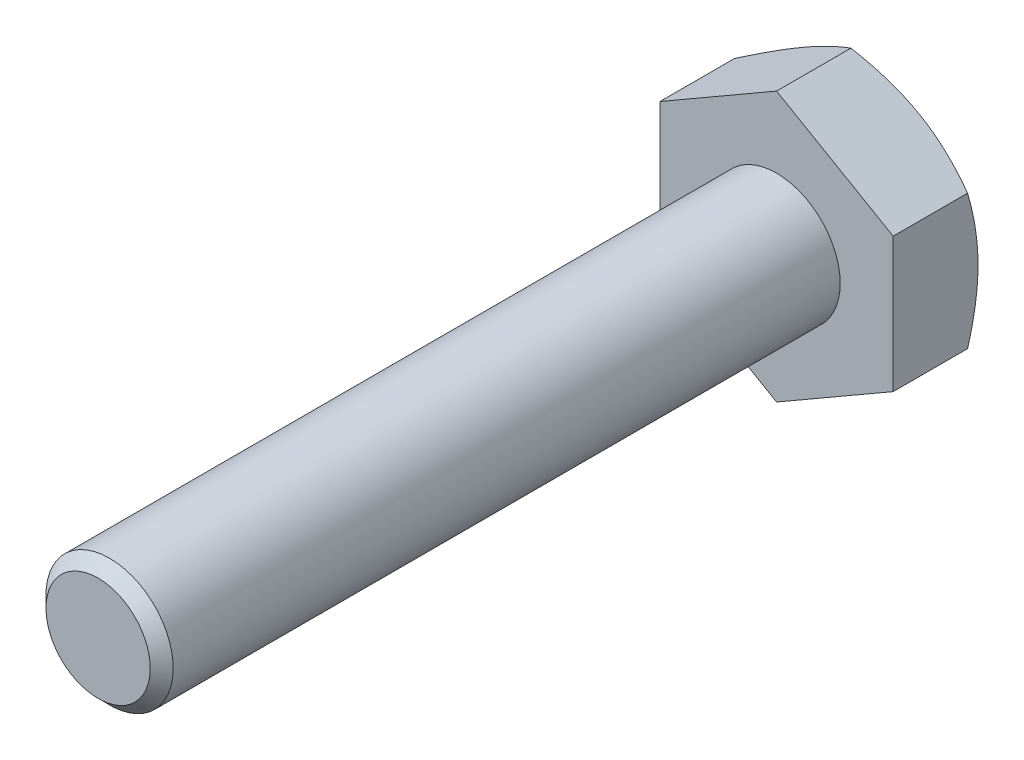
ISO-10303-21;
HEADER;
FILE_DESCRIPTION(('STEP AP214'),'2;1');
FILE_NAME('part.step','',(''),(''),'','','');
FILE_SCHEMA(('AUTOMOTIVE_DESIGN { 1 0 10303 214 1 1 1 1 }'));
ENDSEC;
DATA;
#1=APPLICATION_CONTEXT('core data for automotive mechanical design processes');
#2=APPLICATION_PROTOCOL_DEFINITION('international standard','automotive_design',2000,#1);
#3=PRODUCT_CONTEXT('',#1,'mechanical');
#4=PRODUCT('Part','Part','',(#3));
#5=PRODUCT_RELATED_PRODUCT_CATEGORY('part','',(#4));
#6=PRODUCT_DEFINITION_FORMATION('','',#4);
#7=PRODUCT_DEFINITION_CONTEXT('part definition',#1,'design');
#8=PRODUCT_DEFINITION('design','',#6,#7);
#9=PRODUCT_DEFINITION_SHAPE('','',#8);
#10=(LENGTH_UNIT() NAMED_UNIT(*) SI_UNIT(.MILLI.,.METRE.));
#11=(NAMED_UNIT(*) PLANE_ANGLE_UNIT() SI_UNIT($,.RADIAN.));
#12=(NAMED_UNIT(*) SI_UNIT($,.STERADIAN.) SOLID_ANGLE_UNIT());
#13=UNCERTAINTY_MEASURE_WITH_UNIT(LENGTH_MEASURE(1.E-05),#10,'distance_accuracy_value','');
#14=(GEOMETRIC_REPRESENTATION_CONTEXT(3) GLOBAL_UNCERTAINTY_ASSIGNED_CONTEXT((#13)) GLOBAL_UNIT_ASSIGNED_CONTEXT((#10,
#11,#12)) REPRESENTATION_CONTEXT('',''));
#15=CARTESIAN_POINT('',(0.,0.,0.));
#16=DIRECTION('',(0.,0.,1.));
#17=DIRECTION('',(1.,0.,0.));
#18=AXIS2_PLACEMENT_3D('',#15,#16,#17);
#19=CARTESIAN_POINT('',(0.,0.,0.));
#20=DIRECTION('',(0.,0.,-1.));
#21=DIRECTION('',(-1.,0.,0.));
#22=AXIS2_PLACEMENT_3D('',#19,#20,#21);
#23=PLANE('',#22);
#24=DIRECTION('',(0.866025403784439,-0.5,0.));
#25=VECTOR('',#24,1.);
#26=CARTESIAN_POINT('',(0.,3.17542648054294,0.));
#27=LINE('',#26,#25);
#28=CARTESIAN_POINT('',(0.,3.17542648054294,0.));
#29=VERTEX_POINT('',#28);
#30=CARTESIAN_POINT('',(2.75,1.58771324027147,0.));
#31=VERTEX_POINT('',#30);
#32=EDGE_CURVE('E9',#29,#31,#27,.T.);
#33=ORIENTED_EDGE('',*,*,#32,.F.);
#34=DIRECTION('',(0.866025403784439,0.5,0.));
#35=VECTOR('',#34,1.);
#36=CARTESIAN_POINT('',(-2.75,1.58771324027147,0.));
#37=LINE('',#36,#35);
#38=CARTESIAN_POINT('',(-2.75,1.58771324027147,0.));
#39=VERTEX_POINT('',#38);
#40=EDGE_CURVE('E19',#39,#29,#37,.T.);
#41=ORIENTED_EDGE('',*,*,#40,.F.);
#42=DIRECTION('',(0.,1.,0.));
#43=VECTOR('',#42,1.);
#44=CARTESIAN_POINT('',(-2.75,-1.58771324027147,0.));
#45=LINE('',#44,#43);
#46=CARTESIAN_POINT('',(-2.75,-1.58771324027147,0.));
#47=VERTEX_POINT('',#46);
#48=EDGE_CURVE('E24',#47,#39,#45,.T.);
#49=ORIENTED_EDGE('',*,*,#48,.F.);
#50=DIRECTION('',(-0.866025403784439,0.5,0.));
#51=VECTOR('',#50,1.);
#52=CARTESIAN_POINT('',(0.,-3.17542648054294,0.));
#53=LINE('',#52,#51);
#54=CARTESIAN_POINT('',(0.,-3.17542648054294,0.));
#55=VERTEX_POINT('',#54);
#56=EDGE_CURVE('E95',#55,#47,#53,.T.);
#57=ORIENTED_EDGE('',*,*,#56,.F.);
#58=DIRECTION('',(-0.866025403784439,-0.5,0.));
#59=VECTOR('',#58,1.);
#60=CARTESIAN_POINT('',(2.75,-1.58771324027147,0.));
#61=LINE('',#60,#59);
#62=CARTESIAN_POINT('',(2.75,-1.58771324027147,0.));
#63=VERTEX_POINT('',#62);
#64=EDGE_CURVE('E119',#63,#55,#61,.T.);
#65=ORIENTED_EDGE('',*,*,#64,.F.);
#66=DIRECTION('',(0.,-1.,0.));
#67=VECTOR('',#66,1.);
#68=CARTESIAN_POINT('',(2.75,1.58771324027147,0.));
#69=LINE('',#68,#67);
#70=EDGE_CURVE('E232',#31,#63,#69,.T.);
#71=ORIENTED_EDGE('',*,*,#70,.F.);
#72=EDGE_LOOP('',(#33,#41,#49,#57,#65,#71));
#73=FACE_BOUND('',#72,.T.);
#74=CARTESIAN_POINT('',(0.,0.,0.));
#75=DIRECTION('',(0.,0.,-1.));
#76=DIRECTION('',(0.,1.,0.));
#77=AXIS2_PLACEMENT_3D('',#74,#75,#76);
#78=CIRCLE('',#77,1.5);
#79=CARTESIAN_POINT('',(0.,-1.5,0.));
#80=VERTEX_POINT('',#79);
#81=EDGE_CURVE('E123',#80,#80,#78,.T.);
#82=ORIENTED_EDGE('',*,*,#81,.T.);
#83=EDGE_LOOP('',(#82));
#84=FACE_BOUND('',#83,.T.);
#85=ADVANCED_FACE('F15',(#73,#84),#23,.F.);
#86=CARTESIAN_POINT('',(0.,0.,-2.));
#87=DIRECTION('',(0.,0.,-1.));
#88=DIRECTION('',(-1.,0.,0.));
#89=AXIS2_PLACEMENT_3D('',#86,#87,#88);
#90=PLANE('',#89);
#91=CARTESIAN_POINT('',(0.,0.,-2.));
#92=DIRECTION('',(0.,0.,1.));
#93=DIRECTION('',(0.,1.,0.));
#94=AXIS2_PLACEMENT_3D('',#91,#92,#93);
#95=CIRCLE('',#94,2.75);
#96=CARTESIAN_POINT('',(1.375,-2.38156986040721,-2.));
#97=VERTEX_POINT('',#96);
#98=CARTESIAN_POINT('',(2.75,0.,-2.));
#99=VERTEX_POINT('',#98);
#100=EDGE_CURVE('E130',#97,#99,#95,.T.);
#101=ORIENTED_EDGE('',*,*,#100,.F.);
#102=CARTESIAN_POINT('',(0.,0.,-2.));
#103=DIRECTION('',(0.,0.,1.));
#104=DIRECTION('',(0.,1.,0.));
#105=AXIS2_PLACEMENT_3D('',#102,#103,#104);
#106=CIRCLE('',#105,2.75);
#107=CARTESIAN_POINT('',(-1.375,-2.38156986040721,-2.));
#108=VERTEX_POINT('',#107);
#109=EDGE_CURVE('E139',#108,#97,#106,.T.);
#110=ORIENTED_EDGE('',*,*,#109,.F.);
#111=CARTESIAN_POINT('',(0.,0.,-2.));
#112=DIRECTION('',(0.,0.,1.));
#113=DIRECTION('',(0.,1.,0.));
#114=AXIS2_PLACEMENT_3D('',#111,#112,#113);
#115=CIRCLE('',#114,2.75);
#116=CARTESIAN_POINT('',(-2.75,0.,-2.));
#117=VERTEX_POINT('',#116);
#118=EDGE_CURVE('E183',#117,#108,#115,.T.);
#119=ORIENTED_EDGE('',*,*,#118,.F.);
#120=CARTESIAN_POINT('',(0.,0.,-2.));
#121=DIRECTION('',(0.,0.,1.));
#122=DIRECTION('',(0.,1.,0.));
#123=AXIS2_PLACEMENT_3D('',#120,#121,#122);
#124=CIRCLE('',#123,2.75);
#125=CARTESIAN_POINT('',(-1.375,2.38156986040721,-2.));
#126=VERTEX_POINT('',#125);
#127=EDGE_CURVE('E195',#126,#117,#124,.T.);
#128=ORIENTED_EDGE('',*,*,#127,.F.);
#129=CARTESIAN_POINT('',(0.,0.,-2.));
#130=DIRECTION('',(0.,0.,1.));
#131=DIRECTION('',(0.,1.,0.));
#132=AXIS2_PLACEMENT_3D('',#129,#130,#131);
#133=CIRCLE('',#132,2.75);
#134=CARTESIAN_POINT('',(1.375,2.38156986040721,-2.));
#135=VERTEX_POINT('',#134);
#136=EDGE_CURVE('E149',#135,#126,#133,.T.);
#137=ORIENTED_EDGE('',*,*,#136,.F.);
#138=CARTESIAN_POINT('',(0.,0.,-2.));
#139=DIRECTION('',(0.,0.,1.));
#140=DIRECTION('',(0.,1.,0.));
#141=AXIS2_PLACEMENT_3D('',#138,#139,#140);
#142=CIRCLE('',#141,2.75);
#143=EDGE_CURVE('E115',#99,#135,#142,.T.);
#144=ORIENTED_EDGE('',*,*,#143,.F.);
#145=EDGE_LOOP('',(#101,#110,#119,#128,#137,#144));
#146=FACE_BOUND('',#145,.T.);
#147=ADVANCED_FACE('F256',(#146),#90,.T.);
#148=CARTESIAN_POINT('',(1.375,2.38156986040721,0.));
#149=DIRECTION('',(0.5,0.866025403784439,0.));
#150=DIRECTION('',(0.866025403784439,-0.5,0.));
#151=AXIS2_PLACEMENT_3D('',#148,#149,#150);
#152=PLANE('',#151);
#153=CARTESIAN_POINT('',(-0.00142582323748943,3.17624967997292,-1.75390444775792));
#154=CARTESIAN_POINT('',(0.736287321003483,2.75033079756067,-2.));
#155=CARTESIAN_POINT('',(1.375,2.38156986040721,-2.));
#156=CARTESIAN_POINT('',(2.01371267899652,2.01280892325374,-2.));
#157=CARTESIAN_POINT('',(2.75142582323749,1.58689004084149,-1.75390444775793));
#158=(BOUNDED_CURVE() B_SPLINE_CURVE(2,(#153,#154,#155,#156,#157),.UNSPECIFIED.,.F.,
.F.) B_SPLINE_CURVE_WITH_KNOTS((3,2,3),(0.,1.6124120093164,3.2248240186328),
.UNSPECIFIED.) CURVE() GEOMETRIC_REPRESENTATION_ITEM() RATIONAL_B_SPLINE_CURVE((1.,
1.03802697460134,1.,1.03802697460133,1.)) REPRESENTATION_ITEM(''));
#159=CARTESIAN_POINT('',(0.,3.17542648054294,-1.75437990693813));
#160=VERTEX_POINT('',#159);
#161=EDGE_CURVE('E211',#160,#135,#158,.T.);
#162=ORIENTED_EDGE('',*,*,#161,.F.);
#163=DIRECTION('',(0.,0.,-1.));
#164=VECTOR('',#163,1.);
#165=CARTESIAN_POINT('',(0.,3.17542648054294,0.));
#166=LINE('',#165,#164);
#167=EDGE_CURVE('E99',#29,#160,#166,.T.);
#168=ORIENTED_EDGE('',*,*,#167,.F.);
#169=ORIENTED_EDGE('',*,*,#32,.T.);
#170=DIRECTION('',(0.,0.,-1.));
#171=VECTOR('',#170,1.);
#172=CARTESIAN_POINT('',(2.75,1.58771324027147,0.));
#173=LINE('',#172,#171);
#174=CARTESIAN_POINT('',(2.75,1.58771324027147,-1.75437990693814));
#175=VERTEX_POINT('',#174);
#176=EDGE_CURVE('E236',#31,#175,#173,.T.);
#177=ORIENTED_EDGE('',*,*,#176,.T.);
#178=CARTESIAN_POINT('',(-0.00142582323748943,3.17624967997292,-1.75390444775792));
#179=CARTESIAN_POINT('',(0.736287321003483,2.75033079756067,-2.));
#180=CARTESIAN_POINT('',(1.375,2.38156986040721,-2.));
#181=CARTESIAN_POINT('',(2.01371267899652,2.01280892325374,-2.));
#182=CARTESIAN_POINT('',(2.75142582323749,1.58689004084149,-1.75390444775793));
#183=(BOUNDED_CURVE() B_SPLINE_CURVE(2,(#178,#179,#180,#181,#182),.UNSPECIFIED.,.F.,
.F.) B_SPLINE_CURVE_WITH_KNOTS((3,2,3),(0.,1.6124120093164,3.2248240186328),
.UNSPECIFIED.) CURVE() GEOMETRIC_REPRESENTATION_ITEM() RATIONAL_B_SPLINE_CURVE((1.,
1.03802697460134,1.,1.03802697460133,1.)) REPRESENTATION_ITEM(''));
#184=EDGE_CURVE('E140',#135,#175,#183,.T.);
#185=ORIENTED_EDGE('',*,*,#184,.F.);
#186=EDGE_LOOP('',(#162,#168,#169,#177,#185));
#187=FACE_BOUND('',#186,.T.);
#188=ADVANCED_FACE('F251',(#187),#152,.T.);
#189=CARTESIAN_POINT('',(-2.75,0.,0.));
#190=DIRECTION('',(-1.,0.,0.));
#191=DIRECTION('',(0.,1.,0.));
#192=AXIS2_PLACEMENT_3D('',#189,#190,#191);
#193=PLANE('',#192);
#194=CARTESIAN_POINT('',(-2.75,-1.58935963913144,-1.75390444775792));
#195=CARTESIAN_POINT('',(-2.75,-0.737521874306932,-2.));
#196=CARTESIAN_POINT('',(-2.75,0.,-2.));
#197=CARTESIAN_POINT('',(-2.75,0.737521874306931,-2.));
#198=CARTESIAN_POINT('',(-2.75,1.58935963913144,-1.75390444775792));
#199=(BOUNDED_CURVE() B_SPLINE_CURVE(2,(#194,#195,#196,#197,#198),.UNSPECIFIED.,.F.,
.F.) B_SPLINE_CURVE_WITH_KNOTS((3,2,3),(0.,1.6124120093164,3.22482401863281),
.UNSPECIFIED.) CURVE() GEOMETRIC_REPRESENTATION_ITEM() RATIONAL_B_SPLINE_CURVE((1.,
1.03802697460135,1.,1.03802697460135,1.)) REPRESENTATION_ITEM(''));
#200=CARTESIAN_POINT('',(-2.75,-1.58771324027147,-1.75437990693813));
#201=VERTEX_POINT('',#200);
#202=EDGE_CURVE('E106',#201,#117,#199,.T.);
#203=ORIENTED_EDGE('',*,*,#202,.F.);
#204=DIRECTION('',(0.,0.,-1.));
#205=VECTOR('',#204,1.);
#206=CARTESIAN_POINT('',(-2.75,-1.58771324027147,0.));
#207=LINE('',#206,#205);
#208=EDGE_CURVE('E102',#47,#201,#207,.T.);
#209=ORIENTED_EDGE('',*,*,#208,.F.);
#210=ORIENTED_EDGE('',*,*,#48,.T.);
#211=DIRECTION('',(0.,0.,-1.));
#212=VECTOR('',#211,1.);
#213=CARTESIAN_POINT('',(-2.75,1.58771324027147,0.));
#214=LINE('',#213,#212);
#215=CARTESIAN_POINT('',(-2.75,1.58771324027147,-1.75437990693813));
#216=VERTEX_POINT('',#215);
#217=EDGE_CURVE('E227',#39,#216,#214,.T.);
#218=ORIENTED_EDGE('',*,*,#217,.T.);
#219=CARTESIAN_POINT('',(-2.75,-1.58935963913144,-1.75390444775792));
#220=CARTESIAN_POINT('',(-2.75,-0.737521874306932,-2.));
#221=CARTESIAN_POINT('',(-2.75,0.,-2.));
#222=CARTESIAN_POINT('',(-2.75,0.737521874306931,-2.));
#223=CARTESIAN_POINT('',(-2.75,1.58935963913144,-1.75390444775792));
#224=(BOUNDED_CURVE() B_SPLINE_CURVE(2,(#219,#220,#221,#222,#223),.UNSPECIFIED.,.F.,
.F.) B_SPLINE_CURVE_WITH_KNOTS((3,2,3),(0.,1.6124120093164,3.22482401863281),
.UNSPECIFIED.) CURVE() GEOMETRIC_REPRESENTATION_ITEM() RATIONAL_B_SPLINE_CURVE((1.,
1.03802697460135,1.,1.03802697460135,1.)) REPRESENTATION_ITEM(''));
#225=EDGE_CURVE('E182',#117,#216,#224,.T.);
#226=ORIENTED_EDGE('',*,*,#225,.F.);
#227=EDGE_LOOP('',(#203,#209,#210,#218,#226));
#228=FACE_BOUND('',#227,.T.);
#229=ADVANCED_FACE('F103',(#228),#193,.T.);
#230=CARTESIAN_POINT('',(-1.375,2.38156986040721,0.));
#231=DIRECTION('',(-0.5,0.866025403784439,0.));
#232=DIRECTION('',(0.866025403784439,0.5,0.));
#233=AXIS2_PLACEMENT_3D('',#230,#231,#232);
#234=PLANE('',#233);
#235=CARTESIAN_POINT('',(-2.75142582323749,1.58689004084149,-1.75390444775792));
#236=CARTESIAN_POINT('',(-2.01371267899652,2.01280892325374,-2.));
#237=CARTESIAN_POINT('',(-1.375,2.38156986040721,-2.));
#238=CARTESIAN_POINT('',(-0.736287321003483,2.75033079756067,-2.));
#239=CARTESIAN_POINT('',(0.00142582323748969,3.17624967997292,-1.75390444775792));
#240=(BOUNDED_CURVE() B_SPLINE_CURVE(2,(#235,#236,#237,#238,#239),.UNSPECIFIED.,.F.,
.F.) B_SPLINE_CURVE_WITH_KNOTS((3,2,3),(0.,1.6124120093164,3.22482401863281),
.UNSPECIFIED.) CURVE() GEOMETRIC_REPRESENTATION_ITEM() RATIONAL_B_SPLINE_CURVE((1.,
1.03802697460133,1.,1.03802697460133,1.)) REPRESENTATION_ITEM(''));
#241=EDGE_CURVE('E190',#216,#126,#240,.T.);
#242=ORIENTED_EDGE('',*,*,#241,.F.);
#243=ORIENTED_EDGE('',*,*,#217,.F.);
#244=ORIENTED_EDGE('',*,*,#40,.T.);
#245=ORIENTED_EDGE('',*,*,#167,.T.);
#246=CARTESIAN_POINT('',(-2.75142582323749,1.58689004084149,-1.75390444775792));
#247=CARTESIAN_POINT('',(-2.01371267899652,2.01280892325374,-2.));
#248=CARTESIAN_POINT('',(-1.375,2.38156986040721,-2.));
#249=CARTESIAN_POINT('',(-0.736287321003483,2.75033079756067,-2.));
#250=CARTESIAN_POINT('',(0.00142582323748969,3.17624967997292,-1.75390444775792));
#251=(BOUNDED_CURVE() B_SPLINE_CURVE(2,(#246,#247,#248,#249,#250),.UNSPECIFIED.,.F.,
.F.) B_SPLINE_CURVE_WITH_KNOTS((3,2,3),(0.,1.6124120093164,3.22482401863281),
.UNSPECIFIED.) CURVE() GEOMETRIC_REPRESENTATION_ITEM() RATIONAL_B_SPLINE_CURVE((1.,
1.03802697460133,1.,1.03802697460133,1.)) REPRESENTATION_ITEM(''));
#252=EDGE_CURVE('E208',#126,#160,#251,.T.);
#253=ORIENTED_EDGE('',*,*,#252,.F.);
#254=EDGE_LOOP('',(#242,#243,#244,#245,#253));
#255=FACE_BOUND('',#254,.T.);
#256=ADVANCED_FACE('F315',(#255),#234,.T.);
#257=CARTESIAN_POINT('',(2.75,0.,0.));
#258=DIRECTION('',(1.,0.,0.));
#259=DIRECTION('',(0.,-1.,0.));
#260=AXIS2_PLACEMENT_3D('',#257,#258,#259);
#261=PLANE('',#260);
#262=CARTESIAN_POINT('',(2.75,1.58935963913144,-1.75390444775792));
#263=CARTESIAN_POINT('',(2.75,0.73752187430693,-2.));
#264=CARTESIAN_POINT('',(2.75,0.,-2.));
#265=CARTESIAN_POINT('',(2.75,-0.737521874306929,-2.));
#266=CARTESIAN_POINT('',(2.75,-1.58935963913144,-1.75390444775792));
#267=(BOUNDED_CURVE() B_SPLINE_CURVE(2,(#262,#263,#264,#265,#266),.UNSPECIFIED.,.F.,
.F.) B_SPLINE_CURVE_WITH_KNOTS((3,2,3),(0.,1.6124120093164,3.22482401863281),
.UNSPECIFIED.) CURVE() GEOMETRIC_REPRESENTATION_ITEM() RATIONAL_B_SPLINE_CURVE((1.,
1.03802697460133,1.,1.03802697460133,1.)) REPRESENTATION_ITEM(''));
#268=CARTESIAN_POINT('',(2.75,-1.58771324027147,-1.75437990693814));
#269=VERTEX_POINT('',#268);
#270=EDGE_CURVE('E124',#99,#269,#267,.T.);
#271=ORIENTED_EDGE('',*,*,#270,.F.);
#272=CARTESIAN_POINT('',(2.75,1.58935963913144,-1.75390444775792));
#273=CARTESIAN_POINT('',(2.75,0.73752187430693,-2.));
#274=CARTESIAN_POINT('',(2.75,0.,-2.));
#275=CARTESIAN_POINT('',(2.75,-0.737521874306929,-2.));
#276=CARTESIAN_POINT('',(2.75,-1.58935963913144,-1.75390444775792));
#277=(BOUNDED_CURVE() B_SPLINE_CURVE(2,(#272,#273,#274,#275,#276),.UNSPECIFIED.,.F.,
.F.) B_SPLINE_CURVE_WITH_KNOTS((3,2,3),(0.,1.6124120093164,3.22482401863281),
.UNSPECIFIED.) CURVE() GEOMETRIC_REPRESENTATION_ITEM() RATIONAL_B_SPLINE_CURVE((1.,
1.03802697460133,1.,1.03802697460133,1.)) REPRESENTATION_ITEM(''));
#278=EDGE_CURVE('E148',#175,#99,#277,.T.);
#279=ORIENTED_EDGE('',*,*,#278,.F.);
#280=ORIENTED_EDGE('',*,*,#176,.F.);
#281=ORIENTED_EDGE('',*,*,#70,.T.);
#282=DIRECTION('',(0.,0.,-1.));
#283=VECTOR('',#282,1.);
#284=CARTESIAN_POINT('',(2.75,-1.58771324027147,0.));
#285=LINE('',#284,#283);
#286=EDGE_CURVE('E109',#63,#269,#285,.T.);
#287=ORIENTED_EDGE('',*,*,#286,.T.);
#288=EDGE_LOOP('',(#271,#279,#280,#281,#287));
#289=FACE_BOUND('',#288,.T.);
#290=ADVANCED_FACE('F246',(#289),#261,.T.);
#291=CARTESIAN_POINT('',(1.375,-2.38156986040721,0.));
#292=DIRECTION('',(0.5,-0.866025403784439,0.));
#293=DIRECTION('',(-0.866025403784439,-0.5,0.));
#294=AXIS2_PLACEMENT_3D('',#291,#292,#293);
#295=PLANE('',#294);
#296=CARTESIAN_POINT('',(2.75142582323749,-1.58689004084149,-1.75390444775792));
#297=CARTESIAN_POINT('',(2.01371267899651,-2.01280892325374,-2.));
#298=CARTESIAN_POINT('',(1.375,-2.38156986040721,-2.));
#299=CARTESIAN_POINT('',(0.736287321003486,-2.75033079756068,-2.));
#300=CARTESIAN_POINT('',(-0.00142582323748752,-3.17624967997292,-1.75390444775793));
#301=(BOUNDED_CURVE() B_SPLINE_CURVE(2,(#296,#297,#298,#299,#300),.UNSPECIFIED.,.F.,
.F.) B_SPLINE_CURVE_WITH_KNOTS((3,2,3),(0.,1.6124120093164,3.2248240186328),
.UNSPECIFIED.) CURVE() GEOMETRIC_REPRESENTATION_ITEM() RATIONAL_B_SPLINE_CURVE((1.,
1.03802697460135,1.,1.03802697460133,1.)) REPRESENTATION_ITEM(''));
#302=CARTESIAN_POINT('',(0.,-3.17542648054294,-1.75437990693814));
#303=VERTEX_POINT('',#302);
#304=EDGE_CURVE('E131',#97,#303,#301,.T.);
#305=ORIENTED_EDGE('',*,*,#304,.F.);
#306=CARTESIAN_POINT('',(2.75142582323749,-1.58689004084149,-1.75390444775792));
#307=CARTESIAN_POINT('',(2.01371267899651,-2.01280892325374,-2.));
#308=CARTESIAN_POINT('',(1.375,-2.38156986040721,-2.));
#309=CARTESIAN_POINT('',(0.736287321003486,-2.75033079756068,-2.));
#310=CARTESIAN_POINT('',(-0.00142582323748752,-3.17624967997292,-1.75390444775793));
#311=(BOUNDED_CURVE() B_SPLINE_CURVE(2,(#306,#307,#308,#309,#310),.UNSPECIFIED.,.F.,
.F.) B_SPLINE_CURVE_WITH_KNOTS((3,2,3),(0.,1.6124120093164,3.2248240186328),
.UNSPECIFIED.) CURVE() GEOMETRIC_REPRESENTATION_ITEM() RATIONAL_B_SPLINE_CURVE((1.,
1.03802697460135,1.,1.03802697460133,1.)) REPRESENTATION_ITEM(''));
#312=EDGE_CURVE('E122',#269,#97,#311,.T.);
#313=ORIENTED_EDGE('',*,*,#312,.F.);
#314=ORIENTED_EDGE('',*,*,#286,.F.);
#315=ORIENTED_EDGE('',*,*,#64,.T.);
#316=DIRECTION('',(0.,0.,-1.));
#317=VECTOR('',#316,1.);
#318=CARTESIAN_POINT('',(0.,-3.17542648054294,0.));
#319=LINE('',#318,#317);
#320=EDGE_CURVE('E113',#55,#303,#319,.T.);
#321=ORIENTED_EDGE('',*,*,#320,.T.);
#322=EDGE_LOOP('',(#305,#313,#314,#315,#321));
#323=FACE_BOUND('',#322,.T.);
#324=ADVANCED_FACE('F17',(#323),#295,.T.);
#325=CARTESIAN_POINT('',(-1.375,-2.38156986040721,0.));
#326=DIRECTION('',(-0.5,-0.866025403784439,0.));
#327=DIRECTION('',(-0.866025403784439,0.5,0.));
#328=AXIS2_PLACEMENT_3D('',#325,#326,#327);
#329=PLANE('',#328);
#330=CARTESIAN_POINT('',(0.00142582323748993,-3.17624967997292,-1.75390444775792));
#331=CARTESIAN_POINT('',(-0.736287321003482,-2.75033079756067,-2.));
#332=CARTESIAN_POINT('',(-1.375,-2.38156986040721,-2.));
#333=CARTESIAN_POINT('',(-2.01371267899651,-2.01280892325374,-2.));
#334=CARTESIAN_POINT('',(-2.75142582323749,-1.58689004084149,-1.75390444775792));
#335=(BOUNDED_CURVE() B_SPLINE_CURVE(2,(#330,#331,#332,#333,#334),.UNSPECIFIED.,.F.,
.F.) B_SPLINE_CURVE_WITH_KNOTS((3,2,3),(0.,1.6124120093164,3.2248240186328),
.UNSPECIFIED.) CURVE() GEOMETRIC_REPRESENTATION_ITEM() RATIONAL_B_SPLINE_CURVE((1.,
1.03802697460134,1.,1.03802697460133,1.)) REPRESENTATION_ITEM(''));
#336=EDGE_CURVE('E178',#108,#201,#335,.T.);
#337=ORIENTED_EDGE('',*,*,#336,.F.);
#338=CARTESIAN_POINT('',(0.00142582323748993,-3.17624967997292,-1.75390444775792));
#339=CARTESIAN_POINT('',(-0.736287321003482,-2.75033079756067,-2.));
#340=CARTESIAN_POINT('',(-1.375,-2.38156986040721,-2.));
#341=CARTESIAN_POINT('',(-2.01371267899651,-2.01280892325374,-2.));
#342=CARTESIAN_POINT('',(-2.75142582323749,-1.58689004084149,-1.75390444775792));
#343=(BOUNDED_CURVE() B_SPLINE_CURVE(2,(#338,#339,#340,#341,#342),.UNSPECIFIED.,.F.,
.F.) B_SPLINE_CURVE_WITH_KNOTS((3,2,3),(0.,1.6124120093164,3.2248240186328),
.UNSPECIFIED.) CURVE() GEOMETRIC_REPRESENTATION_ITEM() RATIONAL_B_SPLINE_CURVE((1.,
1.03802697460134,1.,1.03802697460133,1.)) REPRESENTATION_ITEM(''));
#344=EDGE_CURVE('E129',#303,#108,#343,.T.);
#345=ORIENTED_EDGE('',*,*,#344,.F.);
#346=ORIENTED_EDGE('',*,*,#320,.F.);
#347=ORIENTED_EDGE('',*,*,#56,.T.);
#348=ORIENTED_EDGE('',*,*,#208,.T.);
#349=EDGE_LOOP('',(#337,#345,#346,#347,#348));
#350=FACE_BOUND('',#349,.T.);
#351=ADVANCED_FACE('F111',(#350),#329,.T.);
#352=CARTESIAN_POINT('',(0.,0.,-1.87695222387896));
#353=DIRECTION('',(0.,0.,1.));
#354=DIRECTION('',(0.,1.,0.));
#355=AXIS2_PLACEMENT_3D('',#352,#353,#354);
#356=CONICAL_SURFACE('',#355,2.963125,1.0471975511966);
#357=ORIENTED_EDGE('',*,*,#184,.T.);
#358=ORIENTED_EDGE('',*,*,#278,.T.);
#359=ORIENTED_EDGE('',*,*,#143,.T.);
#360=EDGE_LOOP('',(#357,#358,#359));
#361=FACE_BOUND('',#360,.T.);
#362=ADVANCED_FACE('F248',(#361),#356,.T.);
#363=CARTESIAN_POINT('',(0.,0.,-1.87695222387896));
#364=DIRECTION('',(0.,0.,1.));
#365=DIRECTION('',(0.,1.,0.));
#366=AXIS2_PLACEMENT_3D('',#363,#364,#365);
#367=CONICAL_SURFACE('',#366,2.963125,1.0471975511966);
#368=ORIENTED_EDGE('',*,*,#252,.T.);
#369=ORIENTED_EDGE('',*,*,#161,.T.);
#370=ORIENTED_EDGE('',*,*,#136,.T.);
#371=EDGE_LOOP('',(#368,#369,#370));
#372=FACE_BOUND('',#371,.T.);
#373=ADVANCED_FACE('F259',(#372),#367,.T.);
#374=CARTESIAN_POINT('',(0.,0.,-1.87695222387896));
#375=DIRECTION('',(0.,0.,1.));
#376=DIRECTION('',(0.,1.,0.));
#377=AXIS2_PLACEMENT_3D('',#374,#375,#376);
#378=CONICAL_SURFACE('',#377,2.963125,1.0471975511966);
#379=ORIENTED_EDGE('',*,*,#225,.T.);
#380=ORIENTED_EDGE('',*,*,#241,.T.);
#381=ORIENTED_EDGE('',*,*,#127,.T.);
#382=EDGE_LOOP('',(#379,#380,#381));
#383=FACE_BOUND('',#382,.T.);
#384=ADVANCED_FACE('F264',(#383),#378,.T.);
#385=CARTESIAN_POINT('',(0.,0.,-1.87695222387896));
#386=DIRECTION('',(0.,0.,1.));
#387=DIRECTION('',(0.,1.,0.));
#388=AXIS2_PLACEMENT_3D('',#385,#386,#387);
#389=CONICAL_SURFACE('',#388,2.963125,1.0471975511966);
#390=ORIENTED_EDGE('',*,*,#202,.T.);
#391=ORIENTED_EDGE('',*,*,#118,.T.);
#392=ORIENTED_EDGE('',*,*,#336,.T.);
#393=EDGE_LOOP('',(#390,#391,#392));
#394=FACE_BOUND('',#393,.T.);
#395=ADVANCED_FACE('F267',(#394),#389,.T.);
#396=CARTESIAN_POINT('',(0.,0.,-1.87695222387896));
#397=DIRECTION('',(0.,0.,1.));
#398=DIRECTION('',(0.,1.,0.));
#399=AXIS2_PLACEMENT_3D('',#396,#397,#398);
#400=CONICAL_SURFACE('',#399,2.963125,1.0471975511966);
#401=ORIENTED_EDGE('',*,*,#344,.T.);
#402=ORIENTED_EDGE('',*,*,#109,.T.);
#403=ORIENTED_EDGE('',*,*,#304,.T.);
#404=EDGE_LOOP('',(#401,#402,#403));
#405=FACE_BOUND('',#404,.T.);
#406=ADVANCED_FACE('F266',(#405),#400,.T.);
#407=CARTESIAN_POINT('',(0.,0.,-1.87695222387896));
#408=DIRECTION('',(0.,0.,1.));
#409=DIRECTION('',(0.,1.,0.));
#410=AXIS2_PLACEMENT_3D('',#407,#408,#409);
#411=CONICAL_SURFACE('',#410,2.963125,1.0471975511966);
#412=ORIENTED_EDGE('',*,*,#312,.T.);
#413=ORIENTED_EDGE('',*,*,#100,.T.);
#414=ORIENTED_EDGE('',*,*,#270,.T.);
#415=EDGE_LOOP('',(#412,#413,#414));
#416=FACE_BOUND('',#415,.T.);
#417=ADVANCED_FACE('F275',(#416),#411,.T.);
#418=CARTESIAN_POINT('',(0.,0.6146875,16.));
#419=DIRECTION('',(0.,0.,1.));
#420=DIRECTION('',(0.,1.,0.));
#421=AXIS2_PLACEMENT_3D('',#418,#419,#420);
#422=PLANE('',#421);
#423=CARTESIAN_POINT('',(0.,0.,16.));
#424=DIRECTION('',(0.,0.,1.));
#425=DIRECTION('',(0.,1.,0.));
#426=AXIS2_PLACEMENT_3D('',#423,#424,#425);
#427=CIRCLE('',#426,1.229375);
#428=CARTESIAN_POINT('',(0.,1.229375,16.));
#429=VERTEX_POINT('',#428);
#430=EDGE_CURVE('E120',#429,#429,#427,.T.);
#431=ORIENTED_EDGE('',*,*,#430,.T.);
#432=EDGE_LOOP('',(#431));
#433=FACE_BOUND('',#432,.T.);
#434=ADVANCED_FACE('F290',(#433),#422,.T.);
#435=CARTESIAN_POINT('',(0.,0.,15.8646875));
#436=DIRECTION('',(0.,0.,-1.));
#437=DIRECTION('',(0.,1.,0.));
#438=AXIS2_PLACEMENT_3D('',#435,#436,#437);
#439=CONICAL_SURFACE('',#438,1.3646875,0.78539816339745);
#440=CARTESIAN_POINT('',(0.,0.,15.729375));
#441=DIRECTION('',(0.,0.,1.));
#442=DIRECTION('',(0.,1.,0.));
#443=AXIS2_PLACEMENT_3D('',#440,#441,#442);
#444=CIRCLE('',#443,1.5);
#445=CARTESIAN_POINT('',(0.,1.5,15.729375));
#446=VERTEX_POINT('',#445);
#447=EDGE_CURVE('E176',#446,#446,#444,.T.);
#448=ORIENTED_EDGE('',*,*,#447,.T.);
#449=EDGE_LOOP('',(#448));
#450=FACE_BOUND('',#449,.T.);
#451=ORIENTED_EDGE('',*,*,#430,.F.);
#452=EDGE_LOOP('',(#451));
#453=FACE_BOUND('',#452,.T.);
#454=ADVANCED_FACE('F288',(#450,#453),#439,.T.);
#455=CARTESIAN_POINT('',(0.,0.,7.6646875));
#456=DIRECTION('',(0.,0.,-1.));
#457=DIRECTION('',(0.,1.,0.));
#458=AXIS2_PLACEMENT_3D('',#455,#456,#457);
#459=CYLINDRICAL_SURFACE('',#458,1.5);
#460=ORIENTED_EDGE('',*,*,#81,.F.);
#461=EDGE_LOOP('',(#460));
#462=FACE_BOUND('',#461,.T.);
#463=ORIENTED_EDGE('',*,*,#447,.F.);
#464=EDGE_LOOP('',(#463));
#465=FACE_BOUND('',#464,.T.);
#466=ADVANCED_FACE('F287',(#462,#465),#459,.T.);
#467=CLOSED_SHELL('',(#85,#147,#188,#229,#256,#290,#324,#351,#362,#373,#384,#395,#406,#417,#434,
#454,#466));
#468=MANIFOLD_SOLID_BREP('B1',#467);
#469=ADVANCED_BREP_SHAPE_REPRESENTATION('',(#18,#468),#14);
#470=SHAPE_DEFINITION_REPRESENTATION(#9,#469);
ENDSEC;
END-ISO-10303-21;
